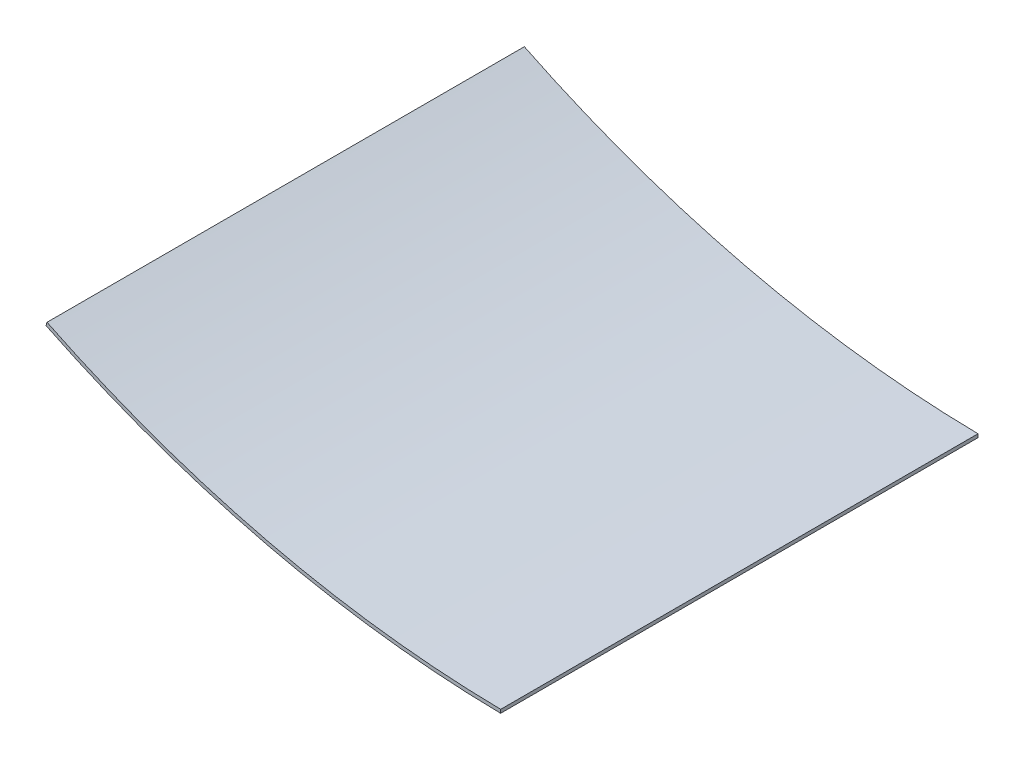
ISO-10303-21;
HEADER;
FILE_DESCRIPTION(('STEP AP214'),'2;1');
FILE_NAME('part.step','',(''),(''),'','','');
FILE_SCHEMA(('AUTOMOTIVE_DESIGN { 1 0 10303 214 1 1 1 1 }'));
ENDSEC;
DATA;
#1=APPLICATION_CONTEXT('core data for automotive mechanical design processes');
#2=APPLICATION_PROTOCOL_DEFINITION('international standard','automotive_design',2000,#1);
#3=PRODUCT_CONTEXT('',#1,'mechanical');
#4=PRODUCT('Part','Part','',(#3));
#5=PRODUCT_RELATED_PRODUCT_CATEGORY('part','',(#4));
#6=PRODUCT_DEFINITION_FORMATION('','',#4);
#7=PRODUCT_DEFINITION_CONTEXT('part definition',#1,'design');
#8=PRODUCT_DEFINITION('design','',#6,#7);
#9=PRODUCT_DEFINITION_SHAPE('','',#8);
#10=(LENGTH_UNIT() NAMED_UNIT(*) SI_UNIT(.MILLI.,.METRE.));
#11=(NAMED_UNIT(*) PLANE_ANGLE_UNIT() SI_UNIT($,.RADIAN.));
#12=(NAMED_UNIT(*) SI_UNIT($,.STERADIAN.) SOLID_ANGLE_UNIT());
#13=UNCERTAINTY_MEASURE_WITH_UNIT(LENGTH_MEASURE(1.E-05),#10,'distance_accuracy_value','');
#14=(GEOMETRIC_REPRESENTATION_CONTEXT(3) GLOBAL_UNCERTAINTY_ASSIGNED_CONTEXT((#13)) GLOBAL_UNIT_ASSIGNED_CONTEXT((#10,
#11,#12)) REPRESENTATION_CONTEXT('',''));
#15=CARTESIAN_POINT('',(0.,0.,0.));
#16=DIRECTION('',(0.,0.,1.));
#17=DIRECTION('',(1.,0.,0.));
#18=AXIS2_PLACEMENT_3D('',#15,#16,#17);
#19=CARTESIAN_POINT('',(13.7520200765498,1214.44694123842,-860.935135679595));
#20=DIRECTION('',(0.,0.,1.));
#21=DIRECTION('',(1.,0.,0.));
#22=AXIS2_PLACEMENT_3D('',#19,#20,#21);
#23=CYLINDRICAL_SURFACE('',#22,971.550000000017);
#24=CARTESIAN_POINT('',(13.7520200765498,1214.44694123842,-434.599999987999));
#25=DIRECTION('',(0.,0.,1.));
#26=DIRECTION('',(1.,0.,0.));
#27=AXIS2_PLACEMENT_3D('',#24,#25,#26);
#28=CIRCLE('',#27,971.550000000017);
#29=CARTESIAN_POINT('',(-413.059075646452,341.668795849935,-434.599999987999));
#30=VERTEX_POINT('',#29);
#31=CARTESIAN_POINT('',(-5.2404434958131E-10,242.994274123942,-434.599999987999));
#32=VERTEX_POINT('',#31);
#33=EDGE_CURVE('E95',#30,#32,#28,.T.);
#34=ORIENTED_EDGE('',*,*,#33,.F.);
#35=DIRECTION('',(0.,0.,1.));
#36=VECTOR('',#35,1.);
#37=CARTESIAN_POINT('',(-413.059075646453,341.668795849935,-860.935135679595));
#38=LINE('',#37,#36);
#39=CARTESIAN_POINT('',(-413.059075646453,341.668795849935,0.));
#40=VERTEX_POINT('',#39);
#41=EDGE_CURVE('E37',#30,#40,#38,.T.);
#42=ORIENTED_EDGE('',*,*,#41,.T.);
#43=CARTESIAN_POINT('',(13.7520200765498,1214.44694123842,0.));
#44=DIRECTION('',(0.,0.,-1.));
#45=DIRECTION('',(-1.,0.,0.));
#46=AXIS2_PLACEMENT_3D('',#43,#44,#45);
#47=CIRCLE('',#46,971.550000000017);
#48=CARTESIAN_POINT('',(-5.2404434958131E-10,242.994274123942,0.));
#49=VERTEX_POINT('',#48);
#50=EDGE_CURVE('E101',#49,#40,#47,.T.);
#51=ORIENTED_EDGE('',*,*,#50,.F.);
#52=DIRECTION('',(0.,0.,1.));
#53=VECTOR('',#52,1.);
#54=CARTESIAN_POINT('',(-5.2404434958131E-10,242.994274123942,-860.935135679595));
#55=LINE('',#54,#53);
#56=EDGE_CURVE('E85',#32,#49,#55,.T.);
#57=ORIENTED_EDGE('',*,*,#56,.F.);
#58=EDGE_LOOP('',(#34,#42,#51,#57));
#59=FACE_BOUND('',#58,.T.);
#60=ADVANCED_FACE('F33',(#59),#23,.F.);
#61=CARTESIAN_POINT('',(-5.2404434958131E-10,242.994274123942,-860.935135679595));
#62=DIRECTION('',(0.999899816905419,-0.0141547219156285,0.));
#63=DIRECTION('',(0.0141547219156285,0.999899816905419,0.));
#64=AXIS2_PLACEMENT_3D('',#61,#62,#63);
#65=PLANE('',#64);
#66=DIRECTION('',(-0.0141547219156285,-0.999899816905419,0.));
#67=VECTOR('',#66,1.);
#68=CARTESIAN_POINT('',(-5.2404434958131E-10,242.994274123942,-434.599999987999));
#69=LINE('',#68,#67);
#70=CARTESIAN_POINT('',(-0.0449412426061641,239.819592205267,-434.599999987999));
#71=VERTEX_POINT('',#70);
#72=EDGE_CURVE('E42',#32,#71,#69,.T.);
#73=ORIENTED_EDGE('',*,*,#72,.F.);
#74=ORIENTED_EDGE('',*,*,#56,.T.);
#75=DIRECTION('',(0.0141547219156285,0.99989981690542,0.));
#76=VECTOR('',#75,1.);
#77=CARTESIAN_POINT('',(-5.2404434958131E-10,242.994274123942,0.));
#78=LINE('',#77,#76);
#79=CARTESIAN_POINT('',(-0.0449412426061641,239.819592205267,0.));
#80=VERTEX_POINT('',#79);
#81=EDGE_CURVE('E91',#80,#49,#78,.T.);
#82=ORIENTED_EDGE('',*,*,#81,.F.);
#83=DIRECTION('',(0.,0.,1.));
#84=VECTOR('',#83,1.);
#85=CARTESIAN_POINT('',(-0.0449412426061641,239.819592205267,-860.935135679595));
#86=LINE('',#85,#84);
#87=EDGE_CURVE('E78',#71,#80,#86,.T.);
#88=ORIENTED_EDGE('',*,*,#87,.F.);
#89=EDGE_LOOP('',(#73,#74,#82,#88));
#90=FACE_BOUND('',#89,.T.);
#91=ADVANCED_FACE('F94',(#90),#65,.T.);
#92=CARTESIAN_POINT('',(13.7520200765498,1214.44694123842,-860.935135679595));
#93=DIRECTION('',(0.,0.,1.));
#94=DIRECTION('',(1.,0.,0.));
#95=AXIS2_PLACEMENT_3D('',#92,#93,#94);
#96=CYLINDRICAL_SURFACE('',#95,974.725000000017);
#97=CARTESIAN_POINT('',(13.7520200765498,1214.44694123842,-434.599999987999));
#98=DIRECTION('',(0.,0.,1.));
#99=DIRECTION('',(1.,0.,0.));
#100=AXIS2_PLACEMENT_3D('',#97,#98,#99);
#101=CIRCLE('',#100,974.725000000017);
#102=CARTESIAN_POINT('',(-413.990806229501,338.590274786229,-434.599999987999));
#103=VERTEX_POINT('',#102);
#104=EDGE_CURVE('E11',#71,#103,#101,.F.);
#105=ORIENTED_EDGE('',*,*,#104,.F.);
#106=ORIENTED_EDGE('',*,*,#87,.T.);
#107=CARTESIAN_POINT('',(13.7520200765498,1214.44694123842,0.));
#108=DIRECTION('',(0.,0.,1.));
#109=DIRECTION('',(-1.,0.,0.));
#110=AXIS2_PLACEMENT_3D('',#107,#108,#109);
#111=CIRCLE('',#110,974.725000000017);
#112=CARTESIAN_POINT('',(-413.990806229501,338.590274786229,0.));
#113=VERTEX_POINT('',#112);
#114=EDGE_CURVE('E81',#113,#80,#111,.T.);
#115=ORIENTED_EDGE('',*,*,#114,.F.);
#116=DIRECTION('',(0.,0.,1.));
#117=VECTOR('',#116,1.);
#118=CARTESIAN_POINT('',(-413.990806229501,338.590274786229,-860.935135679595));
#119=LINE('',#118,#117);
#120=EDGE_CURVE('E55',#103,#113,#119,.T.);
#121=ORIENTED_EDGE('',*,*,#120,.F.);
#122=EDGE_LOOP('',(#105,#106,#115,#121));
#123=FACE_BOUND('',#122,.T.);
#124=ADVANCED_FACE('F80',(#123),#96,.T.);
#125=CARTESIAN_POINT('',(-413.059075646453,341.668795849935,-860.935135679595));
#126=DIRECTION('',(-0.957123976807139,0.289678602973861,0.));
#127=DIRECTION('',(-0.289678602973861,-0.957123976807139,0.));
#128=AXIS2_PLACEMENT_3D('',#125,#126,#127);
#129=PLANE('',#128);
#130=DIRECTION('',(-0.289678602973849,-0.957123976807142,0.));
#131=VECTOR('',#130,1.);
#132=CARTESIAN_POINT('',(-400.14087823983,384.351673867413,-434.599999987999));
#133=LINE('',#132,#131);
#134=EDGE_CURVE('E84',#30,#103,#133,.T.);
#135=ORIENTED_EDGE('',*,*,#134,.T.);
#136=ORIENTED_EDGE('',*,*,#120,.T.);
#137=DIRECTION('',(-0.289678602973861,-0.957123976807139,0.));
#138=VECTOR('',#137,1.);
#139=CARTESIAN_POINT('',(-413.059075646453,341.668795849935,0.));
#140=LINE('',#139,#138);
#141=EDGE_CURVE('E92',#40,#113,#140,.T.);
#142=ORIENTED_EDGE('',*,*,#141,.F.);
#143=ORIENTED_EDGE('',*,*,#41,.F.);
#144=EDGE_LOOP('',(#135,#136,#142,#143));
#145=FACE_BOUND('',#144,.T.);
#146=ADVANCED_FACE('F115',(#145),#129,.T.);
#147=CARTESIAN_POINT('',(13.7520200765498,1214.44694123842,0.));
#148=DIRECTION('',(0.,0.,-1.));
#149=DIRECTION('',(-1.,0.,0.));
#150=AXIS2_PLACEMENT_3D('',#147,#148,#149);
#151=PLANE('',#150);
#152=ORIENTED_EDGE('',*,*,#50,.T.);
#153=ORIENTED_EDGE('',*,*,#141,.T.);
#154=ORIENTED_EDGE('',*,*,#114,.T.);
#155=ORIENTED_EDGE('',*,*,#81,.T.);
#156=EDGE_LOOP('',(#152,#153,#154,#155));
#157=FACE_BOUND('',#156,.T.);
#158=ADVANCED_FACE('F90',(#157),#151,.F.);
#159=CARTESIAN_POINT('',(13.7520200765486,1214.4469412384,-434.599999987999));
#160=DIRECTION('',(0.,0.,1.));
#161=DIRECTION('',(1.,0.,0.));
#162=AXIS2_PLACEMENT_3D('',#159,#160,#161);
#163=PLANE('',#162);
#164=ORIENTED_EDGE('',*,*,#134,.F.);
#165=ORIENTED_EDGE('',*,*,#33,.T.);
#166=ORIENTED_EDGE('',*,*,#72,.T.);
#167=ORIENTED_EDGE('',*,*,#104,.T.);
#168=EDGE_LOOP('',(#164,#165,#166,#167));
#169=FACE_BOUND('',#168,.T.);
#170=ADVANCED_FACE('F35',(#169),#163,.F.);
#171=CLOSED_SHELL('',(#60,#91,#124,#146,#158,#170));
#172=MANIFOLD_SOLID_BREP('B2',#171);
#173=ADVANCED_BREP_SHAPE_REPRESENTATION('',(#18,#172),#14);
#174=SHAPE_DEFINITION_REPRESENTATION(#9,#173);
ENDSEC;
END-ISO-10303-21;
